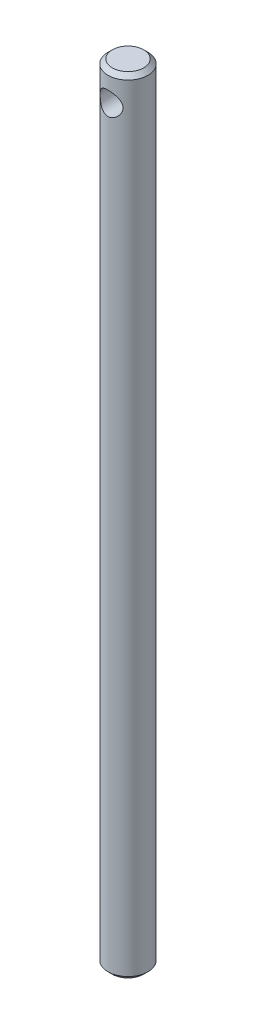
ISO-10303-21;
HEADER;
FILE_DESCRIPTION(('STEP AP214'),'2;1');
FILE_NAME('part.step','',(''),(''),'','','');
FILE_SCHEMA(('AUTOMOTIVE_DESIGN { 1 0 10303 214 1 1 1 1 }'));
ENDSEC;
DATA;
#1=APPLICATION_CONTEXT('core data for automotive mechanical design processes');
#2=APPLICATION_PROTOCOL_DEFINITION('international standard','automotive_design',2000,#1);
#3=PRODUCT_CONTEXT('',#1,'mechanical');
#4=PRODUCT('Part','Part','',(#3));
#5=PRODUCT_RELATED_PRODUCT_CATEGORY('part','',(#4));
#6=PRODUCT_DEFINITION_FORMATION('','',#4);
#7=PRODUCT_DEFINITION_CONTEXT('part definition',#1,'design');
#8=PRODUCT_DEFINITION('design','',#6,#7);
#9=PRODUCT_DEFINITION_SHAPE('','',#8);
#10=(LENGTH_UNIT() NAMED_UNIT(*) SI_UNIT(.MILLI.,.METRE.));
#11=(NAMED_UNIT(*) PLANE_ANGLE_UNIT() SI_UNIT($,.RADIAN.));
#12=(NAMED_UNIT(*) SI_UNIT($,.STERADIAN.) SOLID_ANGLE_UNIT());
#13=UNCERTAINTY_MEASURE_WITH_UNIT(LENGTH_MEASURE(1.E-05),#10,'distance_accuracy_value','');
#14=(GEOMETRIC_REPRESENTATION_CONTEXT(3) GLOBAL_UNCERTAINTY_ASSIGNED_CONTEXT((#13)) GLOBAL_UNIT_ASSIGNED_CONTEXT((#10,
#11,#12)) REPRESENTATION_CONTEXT('',''));
#15=CARTESIAN_POINT('',(0.,0.,0.));
#16=DIRECTION('',(0.,0.,1.));
#17=DIRECTION('',(1.,0.,0.));
#18=AXIS2_PLACEMENT_3D('',#15,#16,#17);
#19=CARTESIAN_POINT('',(0.,550.,0.));
#20=DIRECTION('',(0.,-1.,0.));
#21=DIRECTION('',(0.,0.,-1.));
#22=AXIS2_PLACEMENT_3D('',#19,#20,#21);
#23=CYLINDRICAL_SURFACE('',#22,14.);
#24=CARTESIAN_POINT('',(0.,2.99999999999989,0.));
#25=DIRECTION('',(0.,1.,0.));
#26=DIRECTION('',(0.,0.,1.));
#27=AXIS2_PLACEMENT_3D('',#24,#25,#26);
#28=CIRCLE('',#27,14.);
#29=CARTESIAN_POINT('',(0.,2.99999999999989,14.));
#30=VERTEX_POINT('',#29);
#31=EDGE_CURVE('E41',#30,#30,#28,.T.);
#32=ORIENTED_EDGE('',*,*,#31,.T.);
#33=EDGE_LOOP('',(#32));
#34=FACE_BOUND('',#33,.T.);
#35=CARTESIAN_POINT('',(0.,547.,0.));
#36=DIRECTION('',(0.,1.,0.));
#37=DIRECTION('',(0.,0.,1.));
#38=AXIS2_PLACEMENT_3D('',#35,#36,#37);
#39=CIRCLE('',#38,14.);
#40=CARTESIAN_POINT('',(0.,547.,14.));
#41=VERTEX_POINT('',#40);
#42=EDGE_CURVE('E45',#41,#41,#39,.F.);
#43=ORIENTED_EDGE('',*,*,#42,.T.);
#44=EDGE_LOOP('',(#43));
#45=FACE_BOUND('',#44,.T.);
#46=CARTESIAN_POINT('',(0.,538.,-14.));
#47=CARTESIAN_POINT('',(-0.206348569746244,537.999998224364,-13.9999983893369));
#48=CARTESIAN_POINT('',(-0.412761069135955,537.992003694596,-13.9954259145375));
#49=CARTESIAN_POINT('',(-0.824045281766807,537.960121872044,-13.9772448571329));
#50=CARTESIAN_POINT('',(-1.02891595067142,537.93622464309,-13.9636306251556));
#51=CARTESIAN_POINT('',(-1.43586653932047,537.87278694674,-13.9276735308067));
#52=CARTESIAN_POINT('',(-1.6379400732137,537.83321535363,-13.905313301992));
#53=CARTESIAN_POINT('',(-2.03750144563772,537.738911336563,-13.8524086804955));
#54=CARTESIAN_POINT('',(-2.23498729460728,537.684172463235,-13.8218608064758));
#55=CARTESIAN_POINT('',(-2.6229866271238,537.560501704796,-13.753492145078));
#56=CARTESIAN_POINT('',(-2.81353117234064,537.491645540415,-13.7157102275296));
#57=CARTESIAN_POINT('',(-3.1877160284108,537.340246855622,-13.6336047922152));
#58=CARTESIAN_POINT('',(-3.37135364765758,537.257699066052,-13.5892787567004));
#59=CARTESIAN_POINT('',(-3.73061544758125,537.079735676681,-13.4950716142418));
#60=CARTESIAN_POINT('',(-3.90624557455497,536.984329840522,-13.4451947272462));
#61=CARTESIAN_POINT('',(-4.24892051140751,536.781325470274,-13.3408700481529));
#62=CARTESIAN_POINT('',(-4.41596212781085,536.673722447872,-13.2864205753609));
#63=CARTESIAN_POINT('',(-4.9265397630214,536.317382826651,-13.1097143510966));
#64=CARTESIAN_POINT('',(-5.25367018791813,536.047861110048,-12.9810637749579));
#65=CARTESIAN_POINT('',(-5.86074380744032,535.46169153717,-12.7185432665506));
#66=CARTESIAN_POINT('',(-6.14063083614729,535.144988418745,-12.5846673515521));
#67=CARTESIAN_POINT('',(-6.53509669708748,534.620321118488,-12.3821492731101));
#68=CARTESIAN_POINT('',(-6.66779804940693,534.426714225919,-12.3109985176468));
#69=CARTESIAN_POINT('',(-6.91633609405209,534.027355774223,-12.1731044793822));
#70=CARTESIAN_POINT('',(-7.03217039063037,533.82160249568,-12.1063618234287));
#71=CARTESIAN_POINT('',(-7.24576794106188,533.399233817965,-11.9797436527425));
#72=CARTESIAN_POINT('',(-7.34355336123204,533.182632163477,-11.9198597493716));
#73=CARTESIAN_POINT('',(-7.52008119582336,532.739560655443,-11.8092862055513));
#74=CARTESIAN_POINT('',(-7.59882985768155,532.513094068219,-11.7585935501095));
#75=CARTESIAN_POINT('',(-7.72092307720129,532.102964335676,-11.6786738397758));
#76=CARTESIAN_POINT('',(-7.76824594055137,531.920918649878,-11.6471790362531));
#77=CARTESIAN_POINT('',(-7.85011626579967,531.552805864017,-11.5921574862299));
#78=CARTESIAN_POINT('',(-7.88466626907975,531.366739571729,-11.5686291547403));
#79=CARTESIAN_POINT('',(-7.94052951718446,530.991899518152,-11.5303573667282));
#80=CARTESIAN_POINT('',(-7.96185450866317,530.80312831235,-11.5156061147458));
#81=CARTESIAN_POINT('',(-7.99101531326784,530.424040968728,-11.4953900491863));
#82=CARTESIAN_POINT('',(-7.99885085729661,530.233724800166,-11.4899254208655));
#83=CARTESIAN_POINT('',(-8.00091560230418,529.852723479798,-11.4884877802072));
#84=CARTESIAN_POINT('',(-7.99512629376896,529.66203817808,-11.4925276798745));
#85=CARTESIAN_POINT('',(-7.96999020994449,529.282000164049,-11.5099733805068));
#86=CARTESIAN_POINT('',(-7.95064338105115,529.092647457008,-11.5233792185032));
#87=CARTESIAN_POINT('',(-7.89866004040776,528.716557923956,-11.5590725804429));
#88=CARTESIAN_POINT('',(-7.86601830613306,528.529822155786,-11.5813635946009));
#89=CARTESIAN_POINT('',(-7.78785800443762,528.160169314788,-11.6340656812816));
#90=CARTESIAN_POINT('',(-7.74233423228955,527.977253817606,-11.6644800355966));
#91=CARTESIAN_POINT('',(-7.63915938919789,527.617107222486,-11.7323072245279));
#92=CARTESIAN_POINT('',(-7.58156210593485,527.439854802287,-11.7696889401908));
#93=CARTESIAN_POINT('',(-7.45466636933572,527.090974030703,-11.8504684098295));
#94=CARTESIAN_POINT('',(-7.38536407182205,526.919347549179,-11.8938681394092));
#95=CARTESIAN_POINT('',(-7.16074505049567,526.413972773648,-12.0313994381436));
#96=CARTESIAN_POINT('',(-6.98866463449811,526.08955148929,-12.1328984847101));
#97=CARTESIAN_POINT('',(-6.57289990639237,525.420018360381,-12.3637369542547));
#98=CARTESIAN_POINT('',(-6.32216008287257,525.079922128336,-12.4949312891652));
#99=CARTESIAN_POINT('',(-5.90887064958309,524.602813305915,-12.6928615637109));
#100=CARTESIAN_POINT('',(-5.76479012076699,524.44918122891,-12.7590776838389));
#101=CARTESIAN_POINT('',(-5.46465971718862,524.153474504514,-12.8904731178086));
#102=CARTESIAN_POINT('',(-5.30860782292885,524.011401815488,-12.9556522544684));
#103=CARTESIAN_POINT('',(-4.96665948564026,523.724036803707,-13.0908307597392));
#104=CARTESIAN_POINT('',(-4.77939056313575,523.580232654495,-13.1605295244115));
#105=CARTESIAN_POINT('',(-4.39172346732932,523.309059223626,-13.2949173146522));
#106=CARTESIAN_POINT('',(-4.1913306672178,523.181683278563,-13.3596083671036));
#107=CARTESIAN_POINT('',(-3.77846083465486,522.944513225863,-13.482195287347));
#108=CARTESIAN_POINT('',(-3.56598639628002,522.834715363169,-13.5400926057196));
#109=CARTESIAN_POINT('',(-3.13027267458478,522.633935268624,-13.6474066257637));
#110=CARTESIAN_POINT('',(-2.90703473040872,522.542950703522,-13.6968243789527));
#111=CARTESIAN_POINT('',(-2.46720514786924,522.386620503896,-13.7825824848669));
#112=CARTESIAN_POINT('',(-2.25121893692879,522.319938318597,-13.8195902073993));
#113=CARTESIAN_POINT('',(-1.81300143325591,522.204852061382,-13.8838773153487));
#114=CARTESIAN_POINT('',(-1.59077036807656,522.156447324389,-13.9111570547441));
#115=CARTESIAN_POINT('',(-1.14215203932828,522.078682389119,-13.9551511892739));
#116=CARTESIAN_POINT('',(-0.915768346228856,522.049306552512,-13.971874259801));
#117=CARTESIAN_POINT('',(-0.460783322576202,522.010018885011,-13.9942678679201));
#118=CARTESIAN_POINT('',(-0.232182243142886,522.000104875334,-13.9999396427222));
#119=CARTESIAN_POINT('',(0.197229906606037,521.99990937937,-14.0000521596871));
#120=CARTESIAN_POINT('',(0.39804404929353,522.007389672019,-13.9957732994177));
#121=CARTESIAN_POINT('',(0.798179214814391,522.037390182127,-13.9786623499888));
#122=CARTESIAN_POINT('',(0.997500262461203,522.059910149081,-13.9658304032916));
#123=CARTESIAN_POINT('',(1.39318738006675,522.119703869548,-13.93192242029));
#124=CARTESIAN_POINT('',(1.5895535865009,522.156976939475,-13.9108467659595));
#125=CARTESIAN_POINT('',(1.97801220864612,522.245828623776,-13.8609460155288));
#126=CARTESIAN_POINT('',(2.17010449487689,522.29740767092,-13.832120684994));
#127=CARTESIAN_POINT('',(2.54683230514204,522.413690741554,-13.7677074219834));
#128=CARTESIAN_POINT('',(2.73152507655279,522.478250727227,-13.7321939543204));
#129=CARTESIAN_POINT('',(3.09459684324589,522.620195548232,-13.6549618566839));
#130=CARTESIAN_POINT('',(3.27297372583932,522.697584626667,-13.6132411742012));
#131=CARTESIAN_POINT('',(3.79723591135649,522.947994450514,-13.4800104831147));
#132=CARTESIAN_POINT('',(4.13251492744952,523.139339682791,-13.3803852294842));
#133=CARTESIAN_POINT('',(4.80208853511593,523.587585513523,-13.1558943893105));
#134=CARTESIAN_POINT('',(5.13264806996737,523.849236571404,-13.0294809534364));
#135=CARTESIAN_POINT('',(5.74791024502341,524.419887472119,-12.7700045191381));
#136=CARTESIAN_POINT('',(6.03255964351069,524.728941489338,-12.6369340314703));
#137=CARTESIAN_POINT('',(6.43570879052563,525.242257063991,-12.4341380070402));
#138=CARTESIAN_POINT('',(6.57188486739598,525.43216101906,-12.3625073010677));
#139=CARTESIAN_POINT('',(6.82772138189679,525.824238329347,-12.223068802736));
#140=CARTESIAN_POINT('',(6.94737945273445,526.026413436882,-12.1552615590457));
#141=CARTESIAN_POINT('',(7.16901974882874,526.441835529394,-12.0258731053623));
#142=CARTESIAN_POINT('',(7.27102088399648,526.65507034764,-11.9642852644564));
#143=CARTESIAN_POINT('',(7.4563968721249,527.091677197574,-11.8496427238659));
#144=CARTESIAN_POINT('',(7.53977744890774,527.315046088651,-11.7965854033706));
#145=CARTESIAN_POINT('',(7.67107664210837,527.721838451414,-11.711504014201));
#146=CARTESIAN_POINT('',(7.72276573651977,527.903619071309,-11.6774075139255));
#147=CARTESIAN_POINT('',(7.81335379108548,528.271594656097,-11.616990740506));
#148=CARTESIAN_POINT('',(7.85225531313917,528.457788728763,-11.5906689098694));
#149=CARTESIAN_POINT('',(7.9167594859756,528.833305163515,-11.5467071785352));
#150=CARTESIAN_POINT('',(7.94237461939792,529.02262441626,-11.5290591295899));
#151=CARTESIAN_POINT('',(7.98000413423074,529.403255249739,-11.5030457424611));
#152=CARTESIAN_POINT('',(7.99201830544329,529.594566861218,-11.4946805477408));
#153=CARTESIAN_POINT('',(8.00227476171062,529.978128295651,-11.4875427843935));
#154=CARTESIAN_POINT('',(8.00048910694232,530.170379234014,-11.4887896768698));
#155=CARTESIAN_POINT('',(7.98310713049137,530.553948950389,-11.5008743339446));
#156=CARTESIAN_POINT('',(7.9675107577593,530.745267724953,-11.5117121339946));
#157=CARTESIAN_POINT('',(7.92272696763971,531.125653183175,-11.5425791156925));
#158=CARTESIAN_POINT('',(7.89353221121622,531.314718594114,-11.5626132605151));
#159=CARTESIAN_POINT('',(7.82194996487676,531.689215488588,-11.6111568250217));
#160=CARTESIAN_POINT('',(7.7795622442734,531.87464690852,-11.6396663929035));
#161=CARTESIAN_POINT('',(7.68296440427168,532.237564271559,-11.7036468022726));
#162=CARTESIAN_POINT('',(7.62897591746768,532.415132661254,-11.7389860379718));
#163=CARTESIAN_POINT('',(7.5092894017524,532.764917834745,-11.8159056646947));
#164=CARTESIAN_POINT('',(7.44358736500501,532.937132763074,-11.8574881911132));
#165=CARTESIAN_POINT('',(7.22974900883271,533.444623057435,-11.9899488282758));
#166=CARTESIAN_POINT('',(7.06482957785753,533.7709324008,-12.0885751818032));
#167=CARTESIAN_POINT('',(6.66567889515723,534.443462660542,-12.3137638338276));
#168=CARTESIAN_POINT('',(6.42468511104124,534.785012332883,-12.4422892793399));
#169=CARTESIAN_POINT('',(6.02639848400661,535.265539546352,-12.6374254088518));
#170=CARTESIAN_POINT('',(5.88738664013632,535.420519019265,-12.7029116349465));
#171=CARTESIAN_POINT('',(5.59751359756213,535.719367269414,-12.833279673105));
#172=CARTESIAN_POINT('',(5.44665053210793,535.863234289161,-12.8981613881412));
#173=CARTESIAN_POINT('',(5.11411257857662,536.156373127636,-13.0338791890993));
#174=CARTESIAN_POINT('',(4.93094253741423,536.304076664456,-13.104447151505));
#175=CARTESIAN_POINT('',(4.55126649914855,536.583425490783,-13.2410972877079));
#176=CARTESIAN_POINT('',(4.35476536218306,536.715076584109,-13.3071810789177));
#177=CARTESIAN_POINT('',(3.94939436102825,536.961214261972,-13.4330681963335));
#178=CARTESIAN_POINT('',(3.74052570585976,537.075702520458,-13.4928721348636));
#179=CARTESIAN_POINT('',(3.31169159857951,537.286269179442,-13.6044751727899));
#180=CARTESIAN_POINT('',(3.0917292248676,537.382352651967,-13.6562764768047));
#181=CARTESIAN_POINT('',(2.68225390669621,537.539542134938,-13.7419492722299));
#182=CARTESIAN_POINT('',(2.49428044302461,537.603829662522,-13.7773711005117));
#183=CARTESIAN_POINT('',(2.1129540556424,537.718487077475,-13.8409813174507));
#184=CARTESIAN_POINT('',(1.91960209008935,537.768859426517,-13.8691709854551));
#185=CARTESIAN_POINT('',(1.5292083769049,537.855023143731,-13.9176191594726));
#186=CARTESIAN_POINT('',(1.33217688633407,537.890850107497,-13.9378970225214));
#187=CARTESIAN_POINT('',(0.935388501281416,537.947651944459,-13.9701331346864));
#188=CARTESIAN_POINT('',(0.735633223408041,537.968635267252,-13.982096116899));
#189=CARTESIAN_POINT('',(0.446226919295384,537.988044536859,-13.9931711159956));
#190=CARTESIAN_POINT('',(0.357068890537316,537.992525962839,-13.9957302433796));
#191=CARTESIAN_POINT('',(0.178611242464193,537.998504235222,-13.9991451232899));
#192=CARTESIAN_POINT('',(0.0893116092789582,538.000000768529,-14.0000006971258));
#193=CARTESIAN_POINT('',(0.,538.,-14.));
#194=B_SPLINE_CURVE_WITH_KNOTS('',3,(#46,#47,#48,#49,#50,#51,#52,#53,#54,#55,#56,#57,#58,#59,
#60,#61,#62,#63,#64,#65,#66,#67,#68,#69,#70,#71,#72,#73,#74,#75,#76,#77,#78,#79,#80,#81,#82,#83,
#84,#85,#86,#87,#88,#89,#90,#91,#92,#93,#94,#95,#96,#97,#98,#99,#100,#101,#102,#103,#104,#105,
#106,#107,#108,#109,#110,#111,#112,#113,#114,#115,#116,#117,#118,#119,#120,#121,#122,#123,#124,
#125,#126,#127,#128,#129,#130,#131,#132,#133,#134,#135,#136,#137,#138,#139,#140,#141,#142,#143,
#144,#145,#146,#147,#148,#149,#150,#151,#152,#153,#154,#155,#156,#157,#158,#159,#160,#161,#162,
#163,#164,#165,#166,#167,#168,#169,#170,#171,#172,#173,#174,#175,#176,#177,#178,#179,#180,#181,
#182,#183,#184,#185,#186,#187,#188,#189,#190,#191,#192,#193),.UNSPECIFIED.,.T.,.F.,(4,2,2,2,2,2,
2,2,2,2,2,2,2,2,2,2,2,2,2,2,2,2,2,2,2,2,2,2,2,2,2,2,2,2,2,2,2,2,2,2,2,2,2,2,2,2,2,2,2,2,2,2,2,2,
2,2,2,2,2,2,2,2,2,2,2,2,2,2,2,2,2,2,2,4),(0.,0.618952648092796,1.23829238771076,
1.85886821065711,2.47970831849197,3.09730168442685,3.71513328214306,4.33249835081751,
4.95009133909342,6.27331436113893,7.59809960000251,8.3331184150078,9.06824152832021,
9.80245572078913,10.5364286325235,11.1079866723981,11.6794309296137,12.2503668917707,
12.8213142432367,13.3930376806808,13.9647633786336,14.5367138796694,15.1088957965127,
15.6785808406987,16.2484533467746,17.3876388887967,18.7093804994482,19.3712344355034,
20.0332002689087,20.7708303910484,21.5081603774566,22.2453326434878,22.9824134295208,
23.6685994551746,24.3547605095832,25.0403569452953,25.7258766229929,26.3281366023786,
26.9303865506231,27.5326085968026,28.1348488627904,28.7307427636312,29.3268341455113,
30.5181900190599,31.8335529640759,33.1504305268649,33.8829267780671,34.6155278767511,
35.3473394668916,36.0789257929607,36.6544565618714,37.2298719569023,37.8047457621251,
38.3796284516935,38.9556753821993,39.5317244419928,40.1080847558403,40.684455148282,
41.2506628806031,41.8170647161799,42.9492792354632,44.2558389693987,44.9100916153669,
45.5644475236629,46.3005113583637,47.0363082724252,47.7720333750069,48.507555432349,
49.1123054560148,49.716948427365,50.3201026602578,50.9229132766567,51.190779730085,
51.4586742792773),.UNSPECIFIED.);
#195=CARTESIAN_POINT('',(0.,538.,-14.));
#196=VERTEX_POINT('',#195);
#197=EDGE_CURVE('E50',#196,#196,#194,.T.);
#198=ORIENTED_EDGE('',*,*,#197,.T.);
#199=EDGE_LOOP('',(#198));
#200=FACE_BOUND('',#199,.T.);
#201=CARTESIAN_POINT('',(8.,530.,11.4891252930761));
#202=CARTESIAN_POINT('',(7.99999935787318,529.796467946592,11.489126205359));
#203=CARTESIAN_POINT('',(7.99222093739566,529.592926763103,11.494553805695));
#204=CARTESIAN_POINT('',(7.96123805270269,529.187587176047,11.5160338937242));
#205=CARTESIAN_POINT('',(7.93803253042836,528.985788892978,11.5320871101689));
#206=CARTESIAN_POINT('',(7.87655003429312,528.585429863575,11.5741669846632));
#207=CARTESIAN_POINT('',(7.83826277504619,528.386871423179,11.6002004486793));
#208=CARTESIAN_POINT('',(7.74715252449393,527.994450647354,11.6612446903438));
#209=CARTESIAN_POINT('',(7.69432282300342,527.800590524866,11.6962596117137));
#210=CARTESIAN_POINT('',(7.57521099426554,527.420148141422,11.7737497061029));
#211=CARTESIAN_POINT('',(7.50902563226831,527.233524431491,11.8161709362434));
#212=CARTESIAN_POINT('',(7.36362364874681,526.866958352895,11.9073259259037));
#213=CARTESIAN_POINT('',(7.28440218569753,526.68701849712,11.9560620292922));
#214=CARTESIAN_POINT('',(7.11357880853858,526.334576005232,12.058478218016));
#215=CARTESIAN_POINT('',(7.02197688460668,526.162073375019,12.1121583072737));
#216=CARTESIAN_POINT('',(6.82702919645338,525.825122461031,12.2231048014585));
#217=CARTESIAN_POINT('',(6.72368303206901,525.660674451977,12.280371328557));
#218=CARTESIAN_POINT('',(6.37278986898851,525.144872846215,12.4684628836801));
#219=CARTESIAN_POINT('',(6.10292894790172,524.809843087986,12.6039221101815));
#220=CARTESIAN_POINT('',(5.66068633058362,524.342901250429,12.8055879429556));
#221=CARTESIAN_POINT('',(5.50691703469404,524.193101189047,12.8725995223909));
#222=CARTESIAN_POINT('',(5.18728463853355,523.905888326322,13.0046887929451));
#223=CARTESIAN_POINT('',(5.02141944098823,523.768477682424,13.0697661459275));
#224=CARTESIAN_POINT('',(4.66194414007323,523.494454562713,13.2025153488387));
#225=CARTESIAN_POINT('',(4.46719629801404,523.359165766518,13.269843547386));
#226=CARTESIAN_POINT('',(4.06509696496217,523.105695826404,13.3984892031923));
#227=CARTESIAN_POINT('',(3.85775108894336,522.987507139203,13.4598093068935));
#228=CARTESIAN_POINT('',(3.43166945278213,522.769447252386,13.5746936142742));
#229=CARTESIAN_POINT('',(3.2129379453207,522.669569275626,13.628260685947));
#230=CARTESIAN_POINT('',(2.76555609989001,522.489352294608,13.7260371292073));
#231=CARTESIAN_POINT('',(2.53690721463523,522.409010439977,13.7702478657862));
#232=CARTESIAN_POINT('',(2.09214757578943,522.275235857725,13.844463501064));
#233=CARTESIAN_POINT('',(1.87671473758835,522.220052429283,13.8753785928248));
#234=CARTESIAN_POINT('',(1.44085379358996,522.127671728449,13.9273863603767));
#235=CARTESIAN_POINT('',(1.2204259574686,522.090473487462,13.948479565125));
#236=CARTESIAN_POINT('',(0.776637541640443,522.034648956507,13.9802106559346));
#237=CARTESIAN_POINT('',(0.553279104804067,522.016009787628,13.9908557922715));
#238=CARTESIAN_POINT('',(0.105540206763929,521.997559806652,14.0013923689171));
#239=CARTESIAN_POINT('',(-0.118840162518487,521.997747333309,14.0012847580366));
#240=CARTESIAN_POINT('',(-0.54120483719161,522.015852920796,13.9909458354256));
#241=CARTESIAN_POINT('',(-0.739307140595291,522.031765296803,13.981859727482));
#242=CARTESIAN_POINT('',(-1.13324065436716,522.078188612779,13.9554551892339));
#243=CARTESIAN_POINT('',(-1.32907186265502,522.108699566121,13.9381367513891));
#244=CARTESIAN_POINT('',(-1.71710436673406,522.183951504672,13.8956702176371));
#245=CARTESIAN_POINT('',(-1.90930571233539,522.228692294465,13.8705222292524));
#246=CARTESIAN_POINT('',(-2.28886889231523,522.331899362289,13.8129625584278));
#247=CARTESIAN_POINT('',(-2.4762305329974,522.390366188726,13.7805505857671));
#248=CARTESIAN_POINT('',(-2.8466367631275,522.520992837365,13.708848937922));
#249=CARTESIAN_POINT('',(-3.02963027125488,522.593266258983,13.6695024300594));
#250=CARTESIAN_POINT('',(-3.38869989028845,522.750505100388,13.5849474447185));
#251=CARTESIAN_POINT('',(-3.56477365967581,522.835474770445,13.5397370048669));
#252=CARTESIAN_POINT('',(-4.08133031913792,523.108394886479,13.3966451618644));
#253=CARTESIAN_POINT('',(-4.41038459232621,523.314440586023,13.291255790185));
#254=CARTESIAN_POINT('',(-5.06776505827324,523.794995139369,13.0557768217318));
#255=CARTESIAN_POINT('',(-5.39180398545102,524.07461029329,12.9242417778685));
#256=CARTESIAN_POINT('',(-5.9911815102104,524.681385033515,12.6575416058976));
#257=CARTESIAN_POINT('',(-6.26646020813502,525.008602210645,12.5223722446662));
#258=CARTESIAN_POINT('',(-6.6510318099346,525.548131940427,12.3202140745588));
#259=CARTESIAN_POINT('',(-6.77929998321677,525.745946347992,12.2498990677733));
#260=CARTESIAN_POINT('',(-7.01858679330551,526.153540057659,12.114384638017));
#261=CARTESIAN_POINT('',(-7.12960303865946,526.363321013056,12.049185924883));
#262=CARTESIAN_POINT('',(-7.33310792125625,526.793434743503,11.9264265110216));
#263=CARTESIAN_POINT('',(-7.42562347538946,527.01375160241,11.8688547555418));
#264=CARTESIAN_POINT('',(-7.59114644102661,527.463873789337,11.7636783561548));
#265=CARTESIAN_POINT('',(-7.66416067300526,527.69367576744,11.7160702287904));
#266=CARTESIAN_POINT('',(-7.77516436521672,528.107479605767,11.6426014717043));
#267=CARTESIAN_POINT('',(-7.81734535237599,528.289926345187,11.6142572762409));
#268=CARTESIAN_POINT('',(-7.88893043075296,528.658369043997,11.5657535313694));
#269=CARTESIAN_POINT('',(-7.91833702734712,528.844364299957,11.5455923771137));
#270=CARTESIAN_POINT('',(-7.96397245724536,529.218564338989,11.5141614253525));
#271=CARTESIAN_POINT('',(-7.98021174944459,529.40676724771,11.5028845711787));
#272=CARTESIAN_POINT('',(-7.99932030628692,529.784186845225,11.4896045348875));
#273=CARTESIAN_POINT('',(-8.00218923023241,529.973403559728,11.4876015890837));
#274=CARTESIAN_POINT('',(-7.99451086101233,530.351536747348,11.4929464067712));
#275=CARTESIAN_POINT('',(-7.98395601753631,530.540452991604,11.5002994326084));
#276=CARTESIAN_POINT('',(-7.94957218731956,530.91648864934,11.5240936962739));
#277=CARTESIAN_POINT('',(-7.92574315125816,531.103608056143,11.5405349678698));
#278=CARTESIAN_POINT('',(-7.8651260959167,531.474850481056,11.5819313455294));
#279=CARTESIAN_POINT('',(-7.82833257116855,531.658972191365,11.6068900684511));
#280=CARTESIAN_POINT('',(-7.74222786397824,532.023098930557,11.6645011177748));
#281=CARTESIAN_POINT('',(-7.692911632558,532.203102266983,11.6971565469978));
#282=CARTESIAN_POINT('',(-7.58162634041819,532.560141869278,11.7695963220345));
#283=CARTESIAN_POINT('',(-7.51951208171773,532.737116313668,11.8094617700244));
#284=CARTESIAN_POINT('',(-7.38356659760328,533.085103700357,11.89493119581));
#285=CARTESIAN_POINT('',(-7.30973150719436,533.256114653403,11.9405370655036));
#286=CARTESIAN_POINT('',(-7.07149845059386,533.759196630134,12.0842173417178));
#287=CARTESIAN_POINT('',(-6.89032049811611,534.081482238583,12.1891898336968));
#288=CARTESIAN_POINT('',(-6.45360047243492,534.74708039356,12.4266823079105));
#289=CARTESIAN_POINT('',(-6.19070291613536,535.084980772152,12.5608806999762));
#290=CARTESIAN_POINT('',(-5.75872693500327,535.557219235379,12.7617574258965));
#291=CARTESIAN_POINT('',(-5.60833747142709,535.708963302039,12.8286958092816));
#292=CARTESIAN_POINT('',(-5.29545640963493,536.000318443351,12.9609780736424));
#293=CARTESIAN_POINT('',(-5.13296281627238,536.139927509515,13.0263216893825));
#294=CARTESIAN_POINT('',(-4.77965918089527,536.419546559258,13.1603209238306));
#295=CARTESIAN_POINT('',(-4.58764366412851,536.55819250171,13.2286514542014));
#296=CARTESIAN_POINT('',(-4.19078930808755,536.818620069743,13.3596752056301));
#297=CARTESIAN_POINT('',(-3.98595600979651,536.940408910322,13.4223708344247));
#298=CARTESIAN_POINT('',(-3.56462133850408,537.165929442952,13.5403586587357));
#299=CARTESIAN_POINT('',(-3.34812405783038,537.26966741484,13.5956534274358));
#300=CARTESIAN_POINT('',(-2.90486806319719,537.457860875428,13.6972044211313));
#301=CARTESIAN_POINT('',(-2.67811077283266,537.542319029466,13.7434618953599));
#302=CARTESIAN_POINT('',(-2.23495150027957,537.684703271257,13.8221359016709));
#303=CARTESIAN_POINT('',(-2.01920900667976,537.744229417212,13.8553725686741));
#304=CARTESIAN_POINT('',(-1.58225574682195,537.845172483779,13.9120445173834));
#305=CARTESIAN_POINT('',(-1.36104524050138,537.886590263482,13.9354802640585));
#306=CARTESIAN_POINT('',(-0.915231256113425,537.950662192655,13.9718407363616));
#307=CARTESIAN_POINT('',(-0.690630402021844,537.97333016452,13.9847732048989));
#308=CARTESIAN_POINT('',(-0.239962292564529,537.999584323436,13.9997581872884));
#309=CARTESIAN_POINT('',(-0.0138951821201306,538.003172368371,14.0018117604599));
#310=CARTESIAN_POINT('',(0.411213692102603,537.991915195321,13.9953813703653));
#311=CARTESIAN_POINT('',(0.610333417578036,537.979170298392,13.988098040945));
#312=CARTESIAN_POINT('',(1.00659085045522,537.93891865448,13.9651764704906));
#313=CARTESIAN_POINT('',(1.20372856914467,537.911411991617,13.9495382770656));
#314=CARTESIAN_POINT('',(1.59462422714654,537.841975632371,13.9102754631077));
#315=CARTESIAN_POINT('',(1.78838225509186,537.800046314825,13.8866510523468));
#316=CARTESIAN_POINT('',(2.17126841657198,537.702249210644,13.8319558130634));
#317=CARTESIAN_POINT('',(2.36039638058599,537.646380914497,13.8008847123429));
#318=CARTESIAN_POINT('',(2.73316739886822,537.521203206738,13.7319249529037));
#319=CARTESIAN_POINT('',(2.91680257013087,537.451875455324,13.6940269970792));
#320=CARTESIAN_POINT('',(3.27738544473097,537.300481470461,13.612236659385));
#321=CARTESIAN_POINT('',(3.45433089419798,537.218410990521,13.5683422798058));
#322=CARTESIAN_POINT('',(3.97380675992928,536.954107841711,13.4289644423869));
#323=CARTESIAN_POINT('',(4.30522274065978,536.753699904513,13.3257390030004));
#324=CARTESIAN_POINT('',(4.96733530069177,536.285530109561,13.0943490998098));
#325=CARTESIAN_POINT('',(5.29395096324952,536.012786898998,12.9646906254431));
#326=CARTESIAN_POINT('',(5.89958284052395,535.41983313755,12.7005543738491));
#327=CARTESIAN_POINT('',(6.17854141763053,535.099565972218,12.5660709956994));
#328=CARTESIAN_POINT('',(6.57042581834878,534.56996211836,12.363425415178));
#329=CARTESIAN_POINT('',(6.70181247889653,534.375068304132,12.2924998675349));
#330=CARTESIAN_POINT('',(6.94760836068747,533.973183652657,12.1552671212315));
#331=CARTESIAN_POINT('',(7.06201516193777,533.76619109693,12.0889605815919));
#332=CARTESIAN_POINT('',(7.27261222633215,533.34144266603,11.9634500588359));
#333=CARTESIAN_POINT('',(7.36882687861767,533.123701701946,11.9042366060546));
#334=CARTESIAN_POINT('',(7.54207213091632,532.678460891517,11.795237875964));
#335=CARTESIAN_POINT('',(7.61910923894089,532.450964386578,11.7454494016113));
#336=CARTESIAN_POINT('',(7.73744636878654,532.041169004413,11.6677208755722));
#337=CARTESIAN_POINT('',(7.78289066379248,531.860510507767,11.6373895195056));
#338=CARTESIAN_POINT('',(7.86121615302251,531.495368201456,11.5846242156915));
#339=CARTESIAN_POINT('',(7.89409981314862,531.310885150132,11.5621887178982));
#340=CARTESIAN_POINT('',(7.94687101669036,530.939368878357,11.5259823478464));
#341=CARTESIAN_POINT('',(7.96676875048651,530.752337775378,11.5122046818872));
#342=CARTESIAN_POINT('',(7.99333404464276,530.376873794355,11.4937753836699));
#343=CARTESIAN_POINT('',(8.0000005945152,530.188440810349,11.489124448436));
#344=CARTESIAN_POINT('',(8.,530.,11.4891252930761));
#345=B_SPLINE_CURVE_WITH_KNOTS('',3,(#201,#202,#203,#204,#205,#206,#207,#208,#209,#210,#211,
#212,#213,#214,#215,#216,#217,#218,#219,#220,#221,#222,#223,#224,#225,#226,#227,#228,#229,#230,
#231,#232,#233,#234,#235,#236,#237,#238,#239,#240,#241,#242,#243,#244,#245,#246,#247,#248,#249,
#250,#251,#252,#253,#254,#255,#256,#257,#258,#259,#260,#261,#262,#263,#264,#265,#266,#267,#268,
#269,#270,#271,#272,#273,#274,#275,#276,#277,#278,#279,#280,#281,#282,#283,#284,#285,#286,#287,
#288,#289,#290,#291,#292,#293,#294,#295,#296,#297,#298,#299,#300,#301,#302,#303,#304,#305,#306,
#307,#308,#309,#310,#311,#312,#313,#314,#315,#316,#317,#318,#319,#320,#321,#322,#323,#324,#325,
#326,#327,#328,#329,#330,#331,#332,#333,#334,#335,#336,#337,#338,#339,#340,#341,#342,#343,#344),
.UNSPECIFIED.,.T.,.F.,(4,2,2,2,2,2,2,2,2,2,2,2,2,2,2,2,2,2,2,2,2,2,2,2,2,2,2,2,2,2,2,2,2,2,2,2,
2,2,2,2,2,2,2,2,2,2,2,2,2,2,2,2,2,2,2,2,2,2,2,2,2,2,2,2,2,2,2,2,2,2,2,4),(0.,0.610394126103337,
1.22083012005517,1.8316831395968,2.44281849325877,3.0496754854296,3.65675837123255,
4.26384173867711,4.87094579755479,6.21753747554206,6.89171864533113,7.56601698870426,
8.30456692832726,9.04279007542038,9.78073943799213,10.5185810671458,11.1912108386204,
11.8638043814644,12.5359308577257,13.2079980263196,13.8041314389816,14.4002653976618,
14.9963911700471,15.5925407639334,16.1938249441429,16.795310866662,17.9975256071593,
19.335643409798,20.675393796061,21.4126763910495,22.1500610967486,22.8863650392052,
23.6224111253971,24.1899980120178,24.7574735303865,25.324497855629,25.8915366294474,
26.4588944800693,27.0262544387397,27.5938556220513,28.1616860185037,28.7363534334688,
29.3112107426537,30.4603992702763,31.800643383429,32.4717642760115,33.1429960365516,
33.8815468318411,34.6197805364184,35.3577568961569,36.0956311724703,36.7734445402102,
37.4512257479103,38.1285068475322,38.8057219965162,39.4039821689449,40.0022389322991,
40.6004799826191,41.1987429037137,41.7978268107278,42.3971107915819,43.5948947440243,
44.9242990162926,46.2552998910707,46.9910662175935,47.7269373060545,48.4618147498756,
49.1964424677425,49.7620901204454,50.3276266681387,50.8927188898655,51.4578542669703),.UNSPECIFIED.);
#346=CARTESIAN_POINT('',(8.,530.,11.4891252930761));
#347=VERTEX_POINT('',#346);
#348=EDGE_CURVE('E58',#347,#347,#345,.T.);
#349=ORIENTED_EDGE('',*,*,#348,.T.);
#350=EDGE_LOOP('',(#349));
#351=FACE_BOUND('',#350,.T.);
#352=ADVANCED_FACE('F30',(#34,#45,#200,#351),#23,.T.);
#353=CARTESIAN_POINT('',(0.,550.,0.));
#354=DIRECTION('',(0.,1.,0.));
#355=DIRECTION('',(0.,0.,1.));
#356=AXIS2_PLACEMENT_3D('',#353,#354,#355);
#357=PLANE('',#356);
#358=CARTESIAN_POINT('',(0.,550.,0.));
#359=DIRECTION('',(0.,1.,0.));
#360=DIRECTION('',(0.,0.,1.));
#361=AXIS2_PLACEMENT_3D('',#358,#359,#360);
#362=CIRCLE('',#361,11.);
#363=CARTESIAN_POINT('',(0.,550.,11.));
#364=VERTEX_POINT('',#363);
#365=EDGE_CURVE('E10',#364,#364,#362,.T.);
#366=ORIENTED_EDGE('',*,*,#365,.T.);
#367=EDGE_LOOP('',(#366));
#368=FACE_BOUND('',#367,.T.);
#369=ADVANCED_FACE('F71',(#368),#357,.T.);
#370=CARTESIAN_POINT('',(0.,0.,0.));
#371=DIRECTION('',(0.,1.,0.));
#372=DIRECTION('',(0.,0.,1.));
#373=AXIS2_PLACEMENT_3D('',#370,#371,#372);
#374=PLANE('',#373);
#375=CARTESIAN_POINT('',(0.,0.,0.));
#376=DIRECTION('',(0.,1.,0.));
#377=DIRECTION('',(0.,0.,1.));
#378=AXIS2_PLACEMENT_3D('',#375,#376,#377);
#379=CIRCLE('',#378,11.0000000000001);
#380=CARTESIAN_POINT('',(0.,0.,11.0000000000001));
#381=VERTEX_POINT('',#380);
#382=EDGE_CURVE('E37',#381,#381,#379,.F.);
#383=ORIENTED_EDGE('',*,*,#382,.T.);
#384=EDGE_LOOP('',(#383));
#385=FACE_BOUND('',#384,.T.);
#386=ADVANCED_FACE('F69',(#385),#374,.F.);
#387=CARTESIAN_POINT('',(0.,530.,-14.));
#388=DIRECTION('',(0.,0.,1.));
#389=DIRECTION('',(1.,0.,0.));
#390=AXIS2_PLACEMENT_3D('',#387,#388,#389);
#391=CYLINDRICAL_SURFACE('',#390,8.);
#392=ORIENTED_EDGE('',*,*,#348,.F.);
#393=EDGE_LOOP('',(#392));
#394=FACE_BOUND('',#393,.T.);
#395=ORIENTED_EDGE('',*,*,#197,.F.);
#396=EDGE_LOOP('',(#395));
#397=FACE_BOUND('',#396,.T.);
#398=ADVANCED_FACE('F64',(#394,#397),#391,.F.);
#399=CARTESIAN_POINT('',(0.,2.99999999999989,0.));
#400=DIRECTION('',(0.,1.,0.));
#401=DIRECTION('',(0.,0.,1.));
#402=AXIS2_PLACEMENT_3D('',#399,#400,#401);
#403=CONICAL_SURFACE('',#402,14.,0.785398163397446);
#404=ORIENTED_EDGE('',*,*,#382,.F.);
#405=EDGE_LOOP('',(#404));
#406=FACE_BOUND('',#405,.T.);
#407=ORIENTED_EDGE('',*,*,#31,.F.);
#408=EDGE_LOOP('',(#407));
#409=FACE_BOUND('',#408,.T.);
#410=ADVANCED_FACE('F68',(#406,#409),#403,.T.);
#411=CARTESIAN_POINT('',(0.,550.,0.));
#412=DIRECTION('',(0.,-1.,0.));
#413=DIRECTION('',(0.,0.,-1.));
#414=AXIS2_PLACEMENT_3D('',#411,#412,#413);
#415=CONICAL_SURFACE('',#414,11.,0.785398163397465);
#416=ORIENTED_EDGE('',*,*,#42,.F.);
#417=EDGE_LOOP('',(#416));
#418=FACE_BOUND('',#417,.T.);
#419=ORIENTED_EDGE('',*,*,#365,.F.);
#420=EDGE_LOOP('',(#419));
#421=FACE_BOUND('',#420,.T.);
#422=ADVANCED_FACE('F32',(#418,#421),#415,.T.);
#423=CLOSED_SHELL('',(#352,#369,#386,#398,#410,#422));
#424=MANIFOLD_SOLID_BREP('B2',#423);
#425=ADVANCED_BREP_SHAPE_REPRESENTATION('',(#18,#424),#14);
#426=SHAPE_DEFINITION_REPRESENTATION(#9,#425);
ENDSEC;
END-ISO-10303-21;
